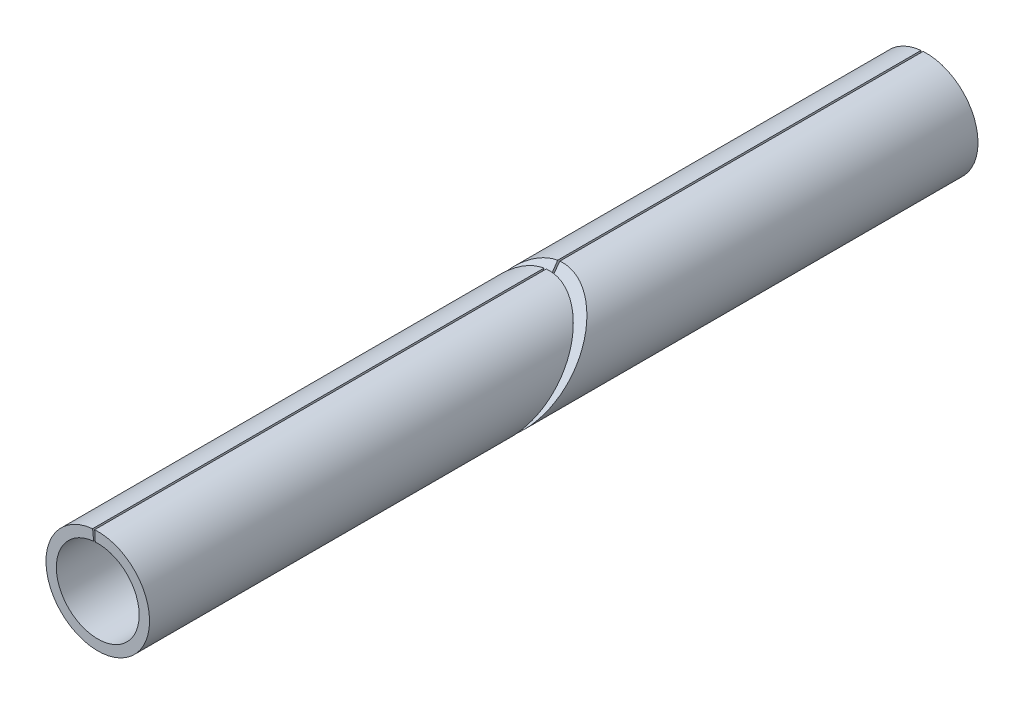
ISO-10303-21;
HEADER;
FILE_DESCRIPTION(('STEP AP214'),'2;1');
FILE_NAME('part.step','',(''),(''),'','','');
FILE_SCHEMA(('AUTOMOTIVE_DESIGN { 1 0 10303 214 1 1 1 1 }'));
ENDSEC;
DATA;
#1=APPLICATION_CONTEXT('core data for automotive mechanical design processes');
#2=APPLICATION_PROTOCOL_DEFINITION('international standard','automotive_design',2000,#1);
#3=PRODUCT_CONTEXT('',#1,'mechanical');
#4=PRODUCT('Part','Part','',(#3));
#5=PRODUCT_RELATED_PRODUCT_CATEGORY('part','',(#4));
#6=PRODUCT_DEFINITION_FORMATION('','',#4);
#7=PRODUCT_DEFINITION_CONTEXT('part definition',#1,'design');
#8=PRODUCT_DEFINITION('design','',#6,#7);
#9=PRODUCT_DEFINITION_SHAPE('','',#8);
#10=(LENGTH_UNIT() NAMED_UNIT(*) SI_UNIT(.MILLI.,.METRE.));
#11=(NAMED_UNIT(*) PLANE_ANGLE_UNIT() SI_UNIT($,.RADIAN.));
#12=(NAMED_UNIT(*) SI_UNIT($,.STERADIAN.) SOLID_ANGLE_UNIT());
#13=UNCERTAINTY_MEASURE_WITH_UNIT(LENGTH_MEASURE(1.E-05),#10,'distance_accuracy_value','');
#14=(GEOMETRIC_REPRESENTATION_CONTEXT(3) GLOBAL_UNCERTAINTY_ASSIGNED_CONTEXT((#13)) GLOBAL_UNIT_ASSIGNED_CONTEXT((#10,
#11,#12)) REPRESENTATION_CONTEXT('',''));
#15=CARTESIAN_POINT('',(0.,0.,0.));
#16=DIRECTION('',(0.,0.,1.));
#17=DIRECTION('',(1.,0.,0.));
#18=AXIS2_PLACEMENT_3D('',#15,#16,#17);
#19=CARTESIAN_POINT('',(-0.376838498807405,6.33880846420024,50.8));
#20=DIRECTION('',(0.99823755341736,0.0593446454814811,0.));
#21=DIRECTION('',(0.,0.,-1.));
#22=AXIS2_PLACEMENT_3D('',#19,#20,#21);
#23=PLANE('',#22);
#24=DIRECTION('',(0.0451595755879909,-0.759630188748703,0.648785472305232));
#25=VECTOR('',#24,1.);
#26=CARTESIAN_POINT('',(-0.24268557525459,4.08221926218137,48.1485356192746));
#27=LINE('',#26,#25);
#28=CARTESIAN_POINT('',(-0.301470799045924,5.07104677136019,47.30399714243));
#29=VERTEX_POINT('',#28);
#30=CARTESIAN_POINT('',(-0.376838498807405,6.33880846420024,46.2212263668049));
#31=VERTEX_POINT('',#30);
#32=EDGE_CURVE('E113',#29,#31,#27,.F.);
#33=ORIENTED_EDGE('',*,*,#32,.F.);
#34=DIRECTION('',(0.,0.,-1.));
#35=VECTOR('',#34,1.);
#36=CARTESIAN_POINT('',(-0.301470799045924,5.07104677136019,101.6));
#37=LINE('',#36,#35);
#38=CARTESIAN_POINT('',(-0.301470799045924,5.07104677136019,101.6));
#39=VERTEX_POINT('',#38);
#40=EDGE_CURVE('E109',#39,#29,#37,.T.);
#41=ORIENTED_EDGE('',*,*,#40,.F.);
#42=DIRECTION('',(0.0593446454814811,-0.99823755341736,0.));
#43=VECTOR('',#42,1.);
#44=CARTESIAN_POINT('',(-0.376838498807405,6.33880846420024,101.6));
#45=LINE('',#44,#43);
#46=CARTESIAN_POINT('',(-0.376838498807405,6.33880846420024,101.6));
#47=VERTEX_POINT('',#46);
#48=EDGE_CURVE('E112',#47,#39,#45,.T.);
#49=ORIENTED_EDGE('',*,*,#48,.F.);
#50=DIRECTION('',(0.,0.,-1.));
#51=VECTOR('',#50,1.);
#52=CARTESIAN_POINT('',(-0.376838498807405,6.33880846420024,101.6));
#53=LINE('',#52,#51);
#54=EDGE_CURVE('E101',#47,#31,#53,.T.);
#55=ORIENTED_EDGE('',*,*,#54,.T.);
#56=EDGE_LOOP('',(#33,#41,#49,#55));
#57=FACE_BOUND('',#56,.T.);
#58=ADVANCED_FACE('F51',(#57),#23,.F.);
#59=CARTESIAN_POINT('',(-0.630838498807406,6.31858708798276,50.8));
#60=DIRECTION('',(0.995053084721694,0.0993446454814812,0.));
#61=DIRECTION('',(0.,0.,-1.));
#62=AXIS2_PLACEMENT_3D('',#59,#60,#61);
#63=PLANE('',#62);
#64=DIRECTION('',(0.075699984508847,-0.758224086802484,0.647584547791174));
#65=VECTOR('',#64,1.);
#66=CARTESIAN_POINT('',(-0.407223861685461,4.07882435715102,48.15143514209));
#67=LINE('',#66,#65);
#68=CARTESIAN_POINT('',(-0.630838498807406,6.31858708798276,46.2384970536657));
#69=VERTEX_POINT('',#68);
#70=CARTESIAN_POINT('',(-0.504670799045925,5.05486967038621,47.3178136919187));
#71=VERTEX_POINT('',#70);
#72=EDGE_CURVE('E60',#69,#71,#67,.T.);
#73=ORIENTED_EDGE('',*,*,#72,.F.);
#74=DIRECTION('',(0.,0.,-1.));
#75=VECTOR('',#74,1.);
#76=CARTESIAN_POINT('',(-0.630838498807406,6.31858708798276,101.6));
#77=LINE('',#76,#75);
#78=CARTESIAN_POINT('',(-0.630838498807406,6.31858708798276,101.6));
#79=VERTEX_POINT('',#78);
#80=EDGE_CURVE('E54',#79,#69,#77,.T.);
#81=ORIENTED_EDGE('',*,*,#80,.F.);
#82=DIRECTION('',(0.0993446454814812,-0.995053084721694,0.));
#83=VECTOR('',#82,1.);
#84=CARTESIAN_POINT('',(-0.630838498807406,6.31858708798276,101.6));
#85=LINE('',#84,#83);
#86=CARTESIAN_POINT('',(-0.504670799045925,5.05486967038621,101.6));
#87=VERTEX_POINT('',#86);
#88=EDGE_CURVE('E87',#79,#87,#85,.T.);
#89=ORIENTED_EDGE('',*,*,#88,.T.);
#90=DIRECTION('',(0.,0.,-1.));
#91=VECTOR('',#90,1.);
#92=CARTESIAN_POINT('',(-0.504670799045925,5.05486967038621,101.6));
#93=LINE('',#92,#91);
#94=EDGE_CURVE('E100',#87,#71,#93,.T.);
#95=ORIENTED_EDGE('',*,*,#94,.T.);
#96=EDGE_LOOP('',(#73,#81,#89,#95));
#97=FACE_BOUND('',#96,.T.);
#98=ADVANCED_FACE('F99',(#97),#63,.T.);
#99=CARTESIAN_POINT('',(0.,0.,101.6));
#100=DIRECTION('',(0.,0.,-1.));
#101=DIRECTION('',(-1.,0.,0.));
#102=AXIS2_PLACEMENT_3D('',#99,#100,#101);
#103=CYLINDRICAL_SURFACE('',#102,5.08);
#104=CARTESIAN_POINT('',(0.,0.,51.6350802449306));
#105=DIRECTION('',(0.,0.649448048330182,0.760405965600032));
#106=DIRECTION('',(0.,0.760405965600033,-0.649448048330182));
#107=AXIS2_PLACEMENT_3D('',#104,#105,#106);
#108=ELLIPSE('',#107,6.68064195944517,5.08);
#109=EDGE_CURVE('E13',#71,#29,#108,.T.);
#110=ORIENTED_EDGE('',*,*,#109,.F.);
#111=ORIENTED_EDGE('',*,*,#94,.F.);
#112=CARTESIAN_POINT('',(0.,0.,101.6));
#113=DIRECTION('',(0.,0.,-1.));
#114=DIRECTION('',(-1.,0.,0.));
#115=AXIS2_PLACEMENT_3D('',#112,#113,#114);
#116=CIRCLE('',#115,5.08);
#117=EDGE_CURVE('E107',#39,#87,#116,.T.);
#118=ORIENTED_EDGE('',*,*,#117,.F.);
#119=ORIENTED_EDGE('',*,*,#40,.T.);
#120=EDGE_LOOP('',(#110,#111,#118,#119));
#121=FACE_BOUND('',#120,.T.);
#122=ADVANCED_FACE('F105',(#121),#103,.F.);
#123=CARTESIAN_POINT('',(0.,0.,101.6));
#124=DIRECTION('',(0.,0.,-1.));
#125=DIRECTION('',(-1.,0.,0.));
#126=AXIS2_PLACEMENT_3D('',#123,#124,#125);
#127=CYLINDRICAL_SURFACE('',#126,6.35);
#128=CARTESIAN_POINT('',(0.,0.,51.6350802449306));
#129=DIRECTION('',(0.,0.649448048330182,0.760405965600032));
#130=DIRECTION('',(0.,0.760405965600033,-0.649448048330182));
#131=AXIS2_PLACEMENT_3D('',#128,#129,#130);
#132=ELLIPSE('',#131,8.35080244930647,6.35);
#133=EDGE_CURVE('E80',#69,#31,#132,.T.);
#134=ORIENTED_EDGE('',*,*,#133,.T.);
#135=ORIENTED_EDGE('',*,*,#54,.F.);
#136=CARTESIAN_POINT('',(0.,0.,101.6));
#137=DIRECTION('',(0.,0.,-1.));
#138=DIRECTION('',(-1.,0.,0.));
#139=AXIS2_PLACEMENT_3D('',#136,#137,#138);
#140=CIRCLE('',#139,6.35);
#141=EDGE_CURVE('E118',#47,#79,#140,.T.);
#142=ORIENTED_EDGE('',*,*,#141,.T.);
#143=ORIENTED_EDGE('',*,*,#80,.T.);
#144=EDGE_LOOP('',(#134,#135,#142,#143));
#145=FACE_BOUND('',#144,.T.);
#146=ADVANCED_FACE('F123',(#145),#127,.T.);
#147=CARTESIAN_POINT('',(0.,0.,101.6));
#148=DIRECTION('',(0.,0.,1.));
#149=DIRECTION('',(1.,0.,0.));
#150=AXIS2_PLACEMENT_3D('',#147,#148,#149);
#151=PLANE('',#150);
#152=ORIENTED_EDGE('',*,*,#141,.F.);
#153=ORIENTED_EDGE('',*,*,#48,.T.);
#154=ORIENTED_EDGE('',*,*,#117,.T.);
#155=ORIENTED_EDGE('',*,*,#88,.F.);
#156=EDGE_LOOP('',(#152,#153,#154,#155));
#157=FACE_BOUND('',#156,.T.);
#158=ADVANCED_FACE('F111',(#157),#151,.T.);
#159=CARTESIAN_POINT('',(-6.35,-13.187969334406,62.8986701339312));
#160=DIRECTION('',(0.,0.649448048330182,0.760405965600032));
#161=DIRECTION('',(0.,-0.760405965600033,0.649448048330182));
#162=AXIS2_PLACEMENT_3D('',#159,#160,#161);
#163=PLANE('',#162);
#164=ORIENTED_EDGE('',*,*,#32,.T.);
#165=ORIENTED_EDGE('',*,*,#133,.F.);
#166=ORIENTED_EDGE('',*,*,#72,.T.);
#167=ORIENTED_EDGE('',*,*,#109,.T.);
#168=EDGE_LOOP('',(#164,#165,#166,#167));
#169=FACE_BOUND('',#168,.T.);
#170=ADVANCED_FACE('F131',(#169),#163,.F.);
#171=CLOSED_SHELL('',(#58,#98,#122,#146,#158,#170));
#172=MANIFOLD_SOLID_BREP('B2',#171);
#173=CARTESIAN_POINT('',(0.,0.,0.));
#174=DIRECTION('',(0.,0.,1.));
#175=DIRECTION('',(1.,0.,0.));
#176=AXIS2_PLACEMENT_3D('',#173,#174,#175);
#177=PLANE('',#176);
#178=DIRECTION('',(0.0593446454814811,-0.99823755341736,0.));
#179=VECTOR('',#178,1.);
#180=CARTESIAN_POINT('',(-0.376838498807405,6.33880846420024,0.));
#181=LINE('',#180,#179);
#182=CARTESIAN_POINT('',(-0.376838498807405,6.33880846420024,0.));
#183=VERTEX_POINT('',#182);
#184=CARTESIAN_POINT('',(-0.301470799045924,5.07104677136019,0.));
#185=VERTEX_POINT('',#184);
#186=EDGE_CURVE('E193',#183,#185,#181,.T.);
#187=ORIENTED_EDGE('',*,*,#186,.F.);
#188=CARTESIAN_POINT('',(0.,0.,0.));
#189=DIRECTION('',(0.,0.,-1.));
#190=DIRECTION('',(-1.,0.,0.));
#191=AXIS2_PLACEMENT_3D('',#188,#189,#190);
#192=CIRCLE('',#191,6.35);
#193=CARTESIAN_POINT('',(-0.630838498807406,6.31858708798276,0.));
#194=VERTEX_POINT('',#193);
#195=EDGE_CURVE('E239',#183,#194,#192,.T.);
#196=ORIENTED_EDGE('',*,*,#195,.T.);
#197=DIRECTION('',(0.0993446454814812,-0.995053084721694,0.));
#198=VECTOR('',#197,1.);
#199=CARTESIAN_POINT('',(-0.630838498807406,6.31858708798276,0.));
#200=LINE('',#199,#198);
#201=CARTESIAN_POINT('',(-0.504670799045925,5.05486967038621,0.));
#202=VERTEX_POINT('',#201);
#203=EDGE_CURVE('E247',#194,#202,#200,.T.);
#204=ORIENTED_EDGE('',*,*,#203,.T.);
#205=CARTESIAN_POINT('',(0.,0.,0.));
#206=DIRECTION('',(0.,0.,-1.));
#207=DIRECTION('',(-1.,0.,0.));
#208=AXIS2_PLACEMENT_3D('',#205,#206,#207);
#209=CIRCLE('',#208,5.08);
#210=EDGE_CURVE('E249',#185,#202,#209,.T.);
#211=ORIENTED_EDGE('',*,*,#210,.F.);
#212=EDGE_LOOP('',(#187,#196,#204,#211));
#213=FACE_BOUND('',#212,.T.);
#214=ADVANCED_FACE('F184',(#213),#177,.F.);
#215=CARTESIAN_POINT('',(0.,0.,101.6));
#216=DIRECTION('',(0.,0.,-1.));
#217=DIRECTION('',(-1.,0.,0.));
#218=AXIS2_PLACEMENT_3D('',#215,#216,#217);
#219=CYLINDRICAL_SURFACE('',#218,6.35);
#220=CARTESIAN_POINT('',(0.,0.,49.9649197550694));
#221=DIRECTION('',(0.,-0.649448048330182,-0.760405965600032));
#222=DIRECTION('',(0.,0.760405965600033,-0.649448048330182));
#223=AXIS2_PLACEMENT_3D('',#220,#221,#222);
#224=ELLIPSE('',#223,8.35080244930647,6.35);
#225=CARTESIAN_POINT('',(-0.376838498807405,6.33880846420024,44.5510658769436));
#226=VERTEX_POINT('',#225);
#227=CARTESIAN_POINT('',(-0.630838498807406,6.31858708798276,44.5683365638045));
#228=VERTEX_POINT('',#227);
#229=EDGE_CURVE('E49',#226,#228,#224,.T.);
#230=ORIENTED_EDGE('',*,*,#229,.T.);
#231=DIRECTION('',(0.,0.,-1.));
#232=VECTOR('',#231,1.);
#233=CARTESIAN_POINT('',(-0.630838498807406,6.31858708798276,101.6));
#234=LINE('',#233,#232);
#235=EDGE_CURVE('E218',#228,#194,#234,.T.);
#236=ORIENTED_EDGE('',*,*,#235,.T.);
#237=ORIENTED_EDGE('',*,*,#195,.F.);
#238=DIRECTION('',(0.,0.,-1.));
#239=VECTOR('',#238,1.);
#240=CARTESIAN_POINT('',(-0.376838498807405,6.33880846420024,101.6));
#241=LINE('',#240,#239);
#242=EDGE_CURVE('E211',#226,#183,#241,.T.);
#243=ORIENTED_EDGE('',*,*,#242,.F.);
#244=EDGE_LOOP('',(#230,#236,#237,#243));
#245=FACE_BOUND('',#244,.T.);
#246=ADVANCED_FACE('F237',(#245),#219,.T.);
#247=CARTESIAN_POINT('',(0.,0.,101.6));
#248=DIRECTION('',(0.,0.,-1.));
#249=DIRECTION('',(-1.,0.,0.));
#250=AXIS2_PLACEMENT_3D('',#247,#248,#249);
#251=CYLINDRICAL_SURFACE('',#250,5.08);
#252=CARTESIAN_POINT('',(0.,0.,49.9649197550694));
#253=DIRECTION('',(0.,-0.649448048330182,-0.760405965600032));
#254=DIRECTION('',(0.,0.760405965600033,-0.649448048330182));
#255=AXIS2_PLACEMENT_3D('',#252,#253,#254);
#256=ELLIPSE('',#255,6.68064195944517,5.08);
#257=CARTESIAN_POINT('',(-0.301470799045924,5.07104677136019,45.6338366525688));
#258=VERTEX_POINT('',#257);
#259=CARTESIAN_POINT('',(-0.504670799045925,5.05486967038621,45.6476532020574));
#260=VERTEX_POINT('',#259);
#261=EDGE_CURVE('E225',#258,#260,#256,.T.);
#262=ORIENTED_EDGE('',*,*,#261,.F.);
#263=DIRECTION('',(0.,0.,-1.));
#264=VECTOR('',#263,1.);
#265=CARTESIAN_POINT('',(-0.301470799045924,5.07104677136019,101.6));
#266=LINE('',#265,#264);
#267=EDGE_CURVE('E201',#258,#185,#266,.T.);
#268=ORIENTED_EDGE('',*,*,#267,.T.);
#269=ORIENTED_EDGE('',*,*,#210,.T.);
#270=DIRECTION('',(0.,0.,-1.));
#271=VECTOR('',#270,1.);
#272=CARTESIAN_POINT('',(-0.504670799045925,5.05486967038621,101.6));
#273=LINE('',#272,#271);
#274=EDGE_CURVE('E241',#260,#202,#273,.T.);
#275=ORIENTED_EDGE('',*,*,#274,.F.);
#276=EDGE_LOOP('',(#262,#268,#269,#275));
#277=FACE_BOUND('',#276,.T.);
#278=ADVANCED_FACE('F258',(#277),#251,.F.);
#279=CARTESIAN_POINT('',(-0.630838498807406,6.31858708798276,50.8));
#280=DIRECTION('',(0.995053084721694,0.0993446454814812,0.));
#281=DIRECTION('',(0.,0.,-1.));
#282=AXIS2_PLACEMENT_3D('',#279,#280,#281);
#283=PLANE('',#282);
#284=DIRECTION('',(-0.075699984508847,0.758224086802484,-0.647584547791174));
#285=VECTOR('',#284,1.);
#286=CARTESIAN_POINT('',(-0.32534901993492,3.25875183638126,47.1816827528975));
#287=LINE('',#286,#285);
#288=EDGE_CURVE('E235',#260,#228,#287,.T.);
#289=ORIENTED_EDGE('',*,*,#288,.F.);
#290=ORIENTED_EDGE('',*,*,#274,.T.);
#291=ORIENTED_EDGE('',*,*,#203,.F.);
#292=ORIENTED_EDGE('',*,*,#235,.F.);
#293=EDGE_LOOP('',(#289,#290,#291,#292));
#294=FACE_BOUND('',#293,.T.);
#295=ADVANCED_FACE('F257',(#294),#283,.T.);
#296=CARTESIAN_POINT('',(-0.376838498807405,6.33880846420024,50.8));
#297=DIRECTION('',(0.99823755341736,0.0593446454814811,0.));
#298=DIRECTION('',(0.,0.,-1.));
#299=AXIS2_PLACEMENT_3D('',#296,#297,#298);
#300=PLANE('',#299);
#301=DIRECTION('',(-0.0451595755879909,0.759630188748703,-0.648785472305232));
#302=VECTOR('',#301,1.);
#303=CARTESIAN_POINT('',(-0.193751749198432,3.25910232542431,47.1813834069754));
#304=LINE('',#303,#302);
#305=EDGE_CURVE('E234',#226,#258,#304,.F.);
#306=ORIENTED_EDGE('',*,*,#305,.F.);
#307=ORIENTED_EDGE('',*,*,#242,.T.);
#308=ORIENTED_EDGE('',*,*,#186,.T.);
#309=ORIENTED_EDGE('',*,*,#267,.F.);
#310=EDGE_LOOP('',(#306,#307,#308,#309));
#311=FACE_BOUND('',#310,.T.);
#312=ADVANCED_FACE('F186',(#311),#300,.F.);
#313=CARTESIAN_POINT('',(-6.35,-14.0127683557853,61.9329545576192));
#314=DIRECTION('',(0.,-0.649448048330182,-0.760405965600032));
#315=DIRECTION('',(0.,0.760405965600033,-0.649448048330182));
#316=AXIS2_PLACEMENT_3D('',#313,#314,#315);
#317=PLANE('',#316);
#318=ORIENTED_EDGE('',*,*,#288,.T.);
#319=ORIENTED_EDGE('',*,*,#229,.F.);
#320=ORIENTED_EDGE('',*,*,#305,.T.);
#321=ORIENTED_EDGE('',*,*,#261,.T.);
#322=EDGE_LOOP('',(#318,#319,#320,#321));
#323=FACE_BOUND('',#322,.T.);
#324=ADVANCED_FACE('F233',(#323),#317,.F.);
#325=CLOSED_SHELL('',(#214,#246,#278,#295,#312,#324));
#326=MANIFOLD_SOLID_BREP('B7_NOT_SHOWN',#325);
#327=ADVANCED_BREP_SHAPE_REPRESENTATION('',(#18,#172,#326),#14);
#328=SHAPE_DEFINITION_REPRESENTATION(#9,#327);
ENDSEC;
END-ISO-10303-21;
